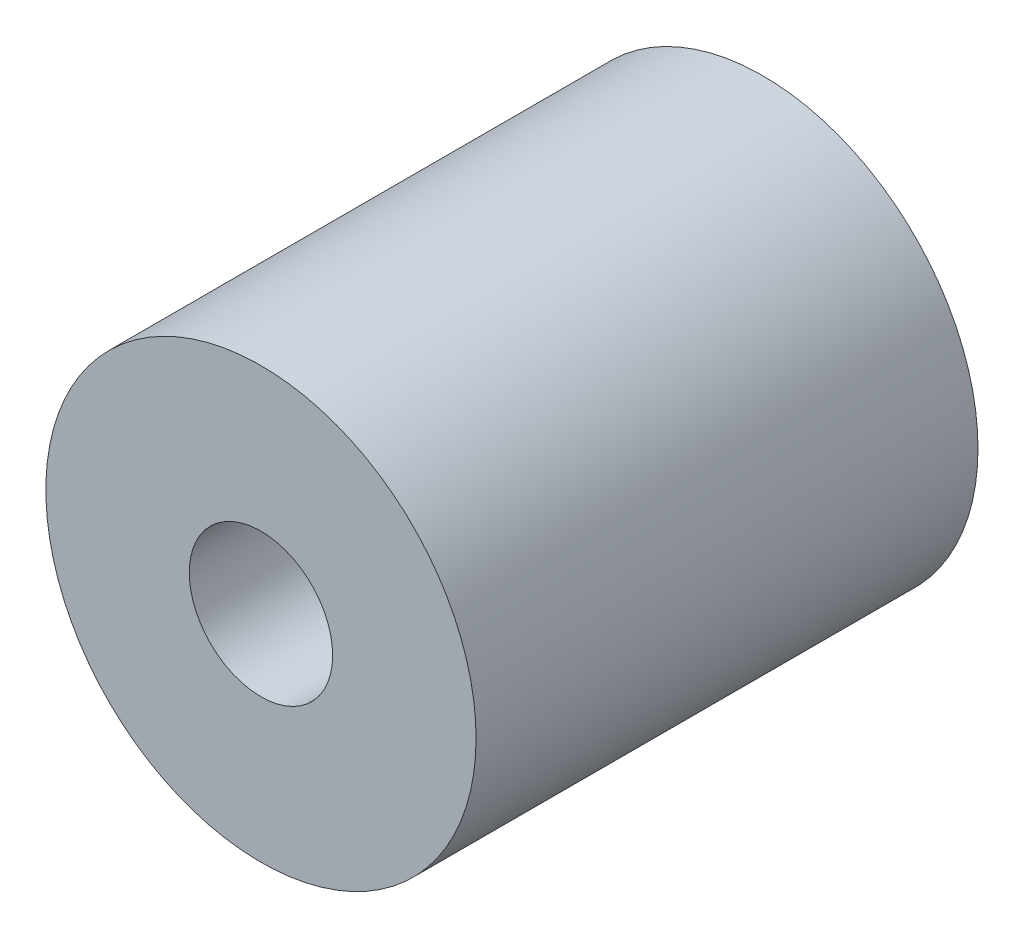
ISO-10303-21;
HEADER;
FILE_DESCRIPTION(('STEP AP214'),'2;1');
FILE_NAME('part.step','',(''),(''),'','','');
FILE_SCHEMA(('AUTOMOTIVE_DESIGN { 1 0 10303 214 1 1 1 1 }'));
ENDSEC;
DATA;
#1=APPLICATION_CONTEXT('core data for automotive mechanical design processes');
#2=APPLICATION_PROTOCOL_DEFINITION('international standard','automotive_design',2000,#1);
#3=PRODUCT_CONTEXT('',#1,'mechanical');
#4=PRODUCT('Part','Part','',(#3));
#5=PRODUCT_RELATED_PRODUCT_CATEGORY('part','',(#4));
#6=PRODUCT_DEFINITION_FORMATION('','',#4);
#7=PRODUCT_DEFINITION_CONTEXT('part definition',#1,'design');
#8=PRODUCT_DEFINITION('design','',#6,#7);
#9=PRODUCT_DEFINITION_SHAPE('','',#8);
#10=(LENGTH_UNIT() NAMED_UNIT(*) SI_UNIT(.MILLI.,.METRE.));
#11=(NAMED_UNIT(*) PLANE_ANGLE_UNIT() SI_UNIT($,.RADIAN.));
#12=(NAMED_UNIT(*) SI_UNIT($,.STERADIAN.) SOLID_ANGLE_UNIT());
#13=UNCERTAINTY_MEASURE_WITH_UNIT(LENGTH_MEASURE(1.E-05),#10,'distance_accuracy_value','');
#14=(GEOMETRIC_REPRESENTATION_CONTEXT(3) GLOBAL_UNCERTAINTY_ASSIGNED_CONTEXT((#13)) GLOBAL_UNIT_ASSIGNED_CONTEXT((#10,
#11,#12)) REPRESENTATION_CONTEXT('',''));
#15=CARTESIAN_POINT('',(0.,0.,0.));
#16=DIRECTION('',(0.,0.,1.));
#17=DIRECTION('',(1.,0.,0.));
#18=AXIS2_PLACEMENT_3D('',#15,#16,#17);
#19=CARTESIAN_POINT('',(0.,0.,0.));
#20=DIRECTION('',(0.,0.,1.));
#21=DIRECTION('',(1.,0.,0.));
#22=AXIS2_PLACEMENT_3D('',#19,#20,#21);
#23=CYLINDRICAL_SURFACE('',#22,3.175);
#24=CARTESIAN_POINT('',(0.,0.,0.));
#25=DIRECTION('',(0.,0.,1.));
#26=DIRECTION('',(1.,0.,0.));
#27=AXIS2_PLACEMENT_3D('',#24,#25,#26);
#28=CIRCLE('',#27,3.175);
#29=CARTESIAN_POINT('',(3.175,0.,0.));
#30=VERTEX_POINT('',#29);
#31=EDGE_CURVE('E27',#30,#30,#28,.T.);
#32=ORIENTED_EDGE('',*,*,#31,.F.);
#33=EDGE_LOOP('',(#32));
#34=FACE_BOUND('',#33,.T.);
#35=CARTESIAN_POINT('',(0.,0.,22.225));
#36=DIRECTION('',(0.,0.,1.));
#37=DIRECTION('',(1.,0.,0.));
#38=AXIS2_PLACEMENT_3D('',#35,#36,#37);
#39=CIRCLE('',#38,3.175);
#40=CARTESIAN_POINT('',(3.175,0.,22.225));
#41=VERTEX_POINT('',#40);
#42=EDGE_CURVE('E18',#41,#41,#39,.T.);
#43=ORIENTED_EDGE('',*,*,#42,.T.);
#44=EDGE_LOOP('',(#43));
#45=FACE_BOUND('',#44,.T.);
#46=ADVANCED_FACE('F15',(#34,#45),#23,.F.);
#47=CARTESIAN_POINT('',(0.,0.,22.225));
#48=DIRECTION('',(0.,0.,-1.));
#49=DIRECTION('',(-1.,0.,0.));
#50=AXIS2_PLACEMENT_3D('',#47,#48,#49);
#51=PLANE('',#50);
#52=CARTESIAN_POINT('',(0.,0.,22.225));
#53=DIRECTION('',(0.,0.,1.));
#54=DIRECTION('',(1.,0.,0.));
#55=AXIS2_PLACEMENT_3D('',#52,#53,#54);
#56=CIRCLE('',#55,9.525);
#57=CARTESIAN_POINT('',(9.525,0.,22.225));
#58=VERTEX_POINT('',#57);
#59=EDGE_CURVE('E22',#58,#58,#56,.F.);
#60=ORIENTED_EDGE('',*,*,#59,.F.);
#61=EDGE_LOOP('',(#60));
#62=FACE_BOUND('',#61,.T.);
#63=ORIENTED_EDGE('',*,*,#42,.F.);
#64=EDGE_LOOP('',(#63));
#65=FACE_BOUND('',#64,.T.);
#66=ADVANCED_FACE('F36',(#62,#65),#51,.F.);
#67=CARTESIAN_POINT('',(0.,0.,0.));
#68=DIRECTION('',(0.,0.,-1.));
#69=DIRECTION('',(-1.,0.,0.));
#70=AXIS2_PLACEMENT_3D('',#67,#68,#69);
#71=PLANE('',#70);
#72=CARTESIAN_POINT('',(0.,0.,0.));
#73=DIRECTION('',(0.,0.,1.));
#74=DIRECTION('',(1.,0.,0.));
#75=AXIS2_PLACEMENT_3D('',#72,#73,#74);
#76=CIRCLE('',#75,9.525);
#77=CARTESIAN_POINT('',(9.525,0.,0.));
#78=VERTEX_POINT('',#77);
#79=EDGE_CURVE('E10',#78,#78,#76,.T.);
#80=ORIENTED_EDGE('',*,*,#79,.F.);
#81=EDGE_LOOP('',(#80));
#82=FACE_BOUND('',#81,.T.);
#83=ORIENTED_EDGE('',*,*,#31,.T.);
#84=EDGE_LOOP('',(#83));
#85=FACE_BOUND('',#84,.T.);
#86=ADVANCED_FACE('F38',(#82,#85),#71,.T.);
#87=CARTESIAN_POINT('',(0.,0.,0.));
#88=DIRECTION('',(0.,0.,1.));
#89=DIRECTION('',(1.,0.,0.));
#90=AXIS2_PLACEMENT_3D('',#87,#88,#89);
#91=CYLINDRICAL_SURFACE('',#90,9.525);
#92=ORIENTED_EDGE('',*,*,#79,.T.);
#93=EDGE_LOOP('',(#92));
#94=FACE_BOUND('',#93,.T.);
#95=ORIENTED_EDGE('',*,*,#59,.T.);
#96=EDGE_LOOP('',(#95));
#97=FACE_BOUND('',#96,.T.);
#98=ADVANCED_FACE('F45',(#94,#97),#91,.T.);
#99=CLOSED_SHELL('',(#46,#66,#86,#98));
#100=MANIFOLD_SOLID_BREP('B1',#99);
#101=ADVANCED_BREP_SHAPE_REPRESENTATION('',(#18,#100),#14);
#102=SHAPE_DEFINITION_REPRESENTATION(#9,#101);
ENDSEC;
END-ISO-10303-21;
